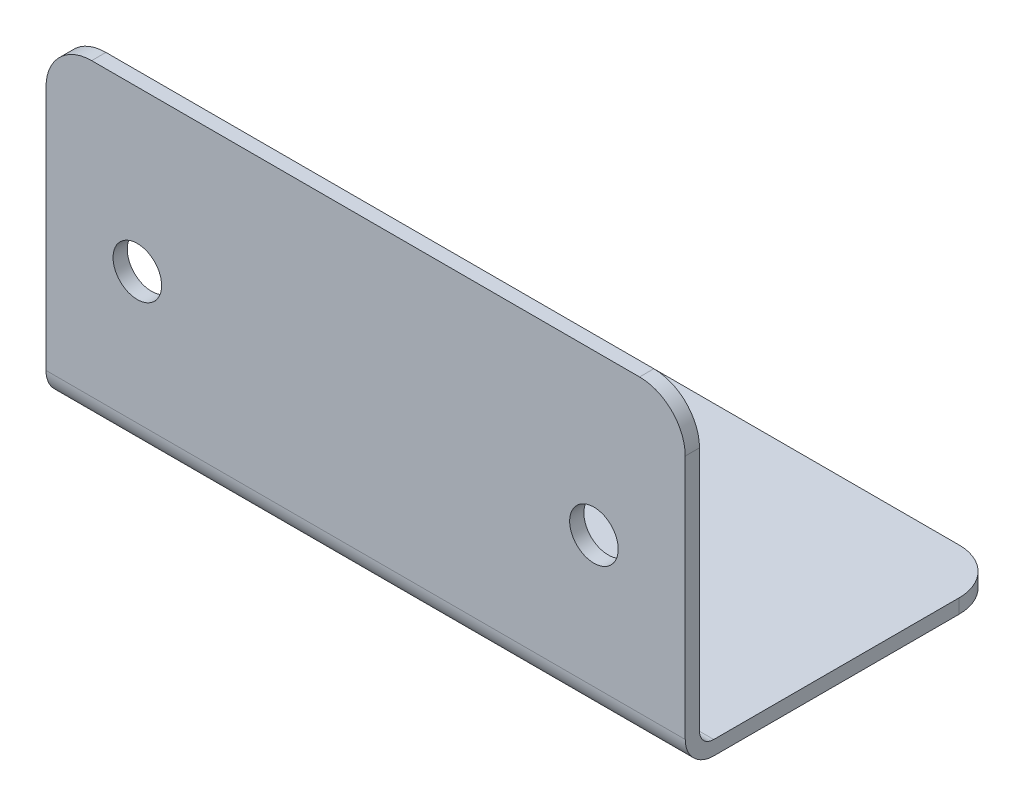
ISO-10303-21;
HEADER;
FILE_DESCRIPTION(('STEP AP214'),'2;1');
FILE_NAME('part.step','',(''),(''),'','','');
FILE_SCHEMA(('AUTOMOTIVE_DESIGN { 1 0 10303 214 1 1 1 1 }'));
ENDSEC;
DATA;
#1=APPLICATION_CONTEXT('core data for automotive mechanical design processes');
#2=APPLICATION_PROTOCOL_DEFINITION('international standard','automotive_design',2000,#1);
#3=PRODUCT_CONTEXT('',#1,'mechanical');
#4=PRODUCT('Part','Part','',(#3));
#5=PRODUCT_RELATED_PRODUCT_CATEGORY('part','',(#4));
#6=PRODUCT_DEFINITION_FORMATION('','',#4);
#7=PRODUCT_DEFINITION_CONTEXT('part definition',#1,'design');
#8=PRODUCT_DEFINITION('design','',#6,#7);
#9=PRODUCT_DEFINITION_SHAPE('','',#8);
#10=(LENGTH_UNIT() NAMED_UNIT(*) SI_UNIT(.MILLI.,.METRE.));
#11=(NAMED_UNIT(*) PLANE_ANGLE_UNIT() SI_UNIT($,.RADIAN.));
#12=(NAMED_UNIT(*) SI_UNIT($,.STERADIAN.) SOLID_ANGLE_UNIT());
#13=UNCERTAINTY_MEASURE_WITH_UNIT(LENGTH_MEASURE(1.E-05),#10,'distance_accuracy_value','');
#14=(GEOMETRIC_REPRESENTATION_CONTEXT(3) GLOBAL_UNCERTAINTY_ASSIGNED_CONTEXT((#13)) GLOBAL_UNIT_ASSIGNED_CONTEXT((#10,
#11,#12)) REPRESENTATION_CONTEXT('',''));
#15=CARTESIAN_POINT('',(0.,0.,0.));
#16=DIRECTION('',(0.,0.,1.));
#17=DIRECTION('',(1.,0.,0.));
#18=AXIS2_PLACEMENT_3D('',#15,#16,#17);
#19=CARTESIAN_POINT('',(88.9,44.45,-1.98119999999999));
#20=DIRECTION('',(0.,-1.,0.));
#21=DIRECTION('',(0.,0.,-1.));
#22=AXIS2_PLACEMENT_3D('',#19,#20,#21);
#23=PLANE('',#22);
#24=DIRECTION('',(-1.,0.,0.));
#25=VECTOR('',#24,1.);
#26=CARTESIAN_POINT('',(88.9,44.45,0.));
#27=LINE('',#26,#25);
#28=CARTESIAN_POINT('',(82.55,44.45,0.));
#29=VERTEX_POINT('',#28);
#30=CARTESIAN_POINT('',(6.34999999999999,44.45,0.));
#31=VERTEX_POINT('',#30);
#32=EDGE_CURVE('E144',#29,#31,#27,.T.);
#33=ORIENTED_EDGE('',*,*,#32,.F.);
#34=DIRECTION('',(0.,0.,1.));
#35=VECTOR('',#34,1.);
#36=CARTESIAN_POINT('',(82.55,44.45,-1.98119999999999));
#37=LINE('',#36,#35);
#38=CARTESIAN_POINT('',(82.55,44.45,-1.98119999999999));
#39=VERTEX_POINT('',#38);
#40=EDGE_CURVE('E58',#29,#39,#37,.F.);
#41=ORIENTED_EDGE('',*,*,#40,.T.);
#42=DIRECTION('',(-1.,0.,0.));
#43=VECTOR('',#42,1.);
#44=CARTESIAN_POINT('',(88.9,44.45,-1.98119999999999));
#45=LINE('',#44,#43);
#46=CARTESIAN_POINT('',(6.34999999999999,44.45,-1.98119999999999));
#47=VERTEX_POINT('',#46);
#48=EDGE_CURVE('E159',#39,#47,#45,.T.);
#49=ORIENTED_EDGE('',*,*,#48,.T.);
#50=DIRECTION('',(0.,0.,1.));
#51=VECTOR('',#50,1.);
#52=CARTESIAN_POINT('',(6.34999999999999,44.45,-1.98119999999999));
#53=LINE('',#52,#51);
#54=EDGE_CURVE('E208',#47,#31,#53,.T.);
#55=ORIENTED_EDGE('',*,*,#54,.T.);
#56=EDGE_LOOP('',(#33,#41,#49,#55));
#57=FACE_BOUND('',#56,.T.);
#58=ADVANCED_FACE('F35',(#57),#23,.F.);
#59=CARTESIAN_POINT('',(88.9,44.45,0.));
#60=DIRECTION('',(0.,0.,-1.));
#61=DIRECTION('',(-1.,0.,0.));
#62=AXIS2_PLACEMENT_3D('',#59,#60,#61);
#63=PLANE('',#62);
#64=CARTESIAN_POINT('',(12.7,22.225,0.));
#65=DIRECTION('',(0.,0.,1.));
#66=DIRECTION('',(1.,0.,0.));
#67=AXIS2_PLACEMENT_3D('',#64,#65,#66);
#68=CIRCLE('',#67,3.3782);
#69=CARTESIAN_POINT('',(16.0782,22.225,0.));
#70=VERTEX_POINT('',#69);
#71=EDGE_CURVE('E214',#70,#70,#68,.T.);
#72=ORIENTED_EDGE('',*,*,#71,.F.);
#73=EDGE_LOOP('',(#72));
#74=FACE_BOUND('',#73,.T.);
#75=CARTESIAN_POINT('',(76.2,22.225,0.));
#76=DIRECTION('',(0.,0.,1.));
#77=DIRECTION('',(1.,0.,0.));
#78=AXIS2_PLACEMENT_3D('',#75,#76,#77);
#79=CIRCLE('',#78,3.37819999999999);
#80=CARTESIAN_POINT('',(79.5782,22.225,0.));
#81=VERTEX_POINT('',#80);
#82=EDGE_CURVE('E220',#81,#81,#79,.T.);
#83=ORIENTED_EDGE('',*,*,#82,.F.);
#84=EDGE_LOOP('',(#83));
#85=FACE_BOUND('',#84,.T.);
#86=DIRECTION('',(0.,-1.,0.));
#87=VECTOR('',#86,1.);
#88=CARTESIAN_POINT('',(88.9,44.45,0.));
#89=LINE('',#88,#87);
#90=CARTESIAN_POINT('',(88.9,38.1,0.));
#91=VERTEX_POINT('',#90);
#92=CARTESIAN_POINT('',(88.9,3.9624,0.));
#93=VERTEX_POINT('',#92);
#94=EDGE_CURVE('E150',#91,#93,#89,.T.);
#95=ORIENTED_EDGE('',*,*,#94,.F.);
#96=CARTESIAN_POINT('',(82.55,38.1,0.));
#97=DIRECTION('',(0.,0.,-1.));
#98=DIRECTION('',(-1.,0.,0.));
#99=AXIS2_PLACEMENT_3D('',#96,#97,#98);
#100=CIRCLE('',#99,6.35);
#101=EDGE_CURVE('E206',#91,#29,#100,.F.);
#102=ORIENTED_EDGE('',*,*,#101,.T.);
#103=ORIENTED_EDGE('',*,*,#32,.T.);
#104=CARTESIAN_POINT('',(6.34999999999999,38.1,0.));
#105=DIRECTION('',(0.,0.,-1.));
#106=DIRECTION('',(-1.,0.,0.));
#107=AXIS2_PLACEMENT_3D('',#104,#105,#106);
#108=CIRCLE('',#107,6.35);
#109=CARTESIAN_POINT('',(0.,38.1,0.));
#110=VERTEX_POINT('',#109);
#111=EDGE_CURVE('E204',#31,#110,#108,.F.);
#112=ORIENTED_EDGE('',*,*,#111,.T.);
#113=DIRECTION('',(0.,-1.,0.));
#114=VECTOR('',#113,1.);
#115=CARTESIAN_POINT('',(0.,44.45,0.));
#116=LINE('',#115,#114);
#117=CARTESIAN_POINT('',(0.,3.9624,0.));
#118=VERTEX_POINT('',#117);
#119=EDGE_CURVE('E218',#110,#118,#116,.T.);
#120=ORIENTED_EDGE('',*,*,#119,.T.);
#121=DIRECTION('',(-1.,0.,0.));
#122=VECTOR('',#121,1.);
#123=CARTESIAN_POINT('',(88.9,3.9624,0.));
#124=LINE('',#123,#122);
#125=EDGE_CURVE('E177',#118,#93,#124,.F.);
#126=ORIENTED_EDGE('',*,*,#125,.T.);
#127=EDGE_LOOP('',(#95,#102,#103,#112,#120,#126));
#128=FACE_BOUND('',#127,.T.);
#129=ADVANCED_FACE('F265',(#74,#85,#128),#63,.F.);
#130=CARTESIAN_POINT('',(88.9,0.,0.));
#131=DIRECTION('',(0.,1.,0.));
#132=DIRECTION('',(0.,0.,1.));
#133=AXIS2_PLACEMENT_3D('',#130,#131,#132);
#134=PLANE('',#133);
#135=DIRECTION('',(0.,0.,-1.));
#136=VECTOR('',#135,1.);
#137=CARTESIAN_POINT('',(0.,0.,0.));
#138=LINE('',#137,#136);
#139=CARTESIAN_POINT('',(0.,0.,-3.9624));
#140=VERTEX_POINT('',#139);
#141=CARTESIAN_POINT('',(0.,0.,-38.1));
#142=VERTEX_POINT('',#141);
#143=EDGE_CURVE('E155',#140,#142,#138,.T.);
#144=ORIENTED_EDGE('',*,*,#143,.T.);
#145=CARTESIAN_POINT('',(6.34999999999999,0.,-38.1));
#146=DIRECTION('',(0.,1.,0.));
#147=DIRECTION('',(0.,0.,1.));
#148=AXIS2_PLACEMENT_3D('',#145,#146,#147);
#149=CIRCLE('',#148,6.35);
#150=CARTESIAN_POINT('',(6.34999999999999,0.,-44.45));
#151=VERTEX_POINT('',#150);
#152=EDGE_CURVE('E196',#142,#151,#149,.F.);
#153=ORIENTED_EDGE('',*,*,#152,.T.);
#154=DIRECTION('',(-1.,0.,0.));
#155=VECTOR('',#154,1.);
#156=CARTESIAN_POINT('',(88.9,0.,-44.45));
#157=LINE('',#156,#155);
#158=CARTESIAN_POINT('',(82.55,0.,-44.45));
#159=VERTEX_POINT('',#158);
#160=EDGE_CURVE('E164',#159,#151,#157,.T.);
#161=ORIENTED_EDGE('',*,*,#160,.F.);
#162=CARTESIAN_POINT('',(82.55,0.,-38.1));
#163=DIRECTION('',(0.,1.,0.));
#164=DIRECTION('',(0.,0.,1.));
#165=AXIS2_PLACEMENT_3D('',#162,#163,#164);
#166=CIRCLE('',#165,6.35);
#167=CARTESIAN_POINT('',(88.9,0.,-38.1));
#168=VERTEX_POINT('',#167);
#169=EDGE_CURVE('E194',#159,#168,#166,.F.);
#170=ORIENTED_EDGE('',*,*,#169,.T.);
#171=DIRECTION('',(0.,0.,-1.));
#172=VECTOR('',#171,1.);
#173=CARTESIAN_POINT('',(88.9,0.,0.));
#174=LINE('',#173,#172);
#175=CARTESIAN_POINT('',(88.9,0.,-3.9624));
#176=VERTEX_POINT('',#175);
#177=EDGE_CURVE('E153',#176,#168,#174,.T.);
#178=ORIENTED_EDGE('',*,*,#177,.F.);
#179=DIRECTION('',(-1.,0.,0.));
#180=VECTOR('',#179,1.);
#181=CARTESIAN_POINT('',(88.9,0.,-3.9624));
#182=LINE('',#181,#180);
#183=EDGE_CURVE('E171',#176,#140,#182,.T.);
#184=ORIENTED_EDGE('',*,*,#183,.T.);
#185=EDGE_LOOP('',(#144,#153,#161,#170,#178,#184));
#186=FACE_BOUND('',#185,.T.);
#187=ADVANCED_FACE('F236',(#186),#134,.F.);
#188=CARTESIAN_POINT('',(88.9,0.,-44.45));
#189=DIRECTION('',(0.,0.,1.));
#190=DIRECTION('',(1.,0.,0.));
#191=AXIS2_PLACEMENT_3D('',#188,#189,#190);
#192=PLANE('',#191);
#193=ORIENTED_EDGE('',*,*,#160,.T.);
#194=DIRECTION('',(0.,1.,0.));
#195=VECTOR('',#194,1.);
#196=CARTESIAN_POINT('',(6.34999999999999,0.,-44.45));
#197=LINE('',#196,#195);
#198=CARTESIAN_POINT('',(6.34999999999999,1.9812,-44.45));
#199=VERTEX_POINT('',#198);
#200=EDGE_CURVE('E184',#151,#199,#197,.T.);
#201=ORIENTED_EDGE('',*,*,#200,.T.);
#202=DIRECTION('',(-1.,0.,0.));
#203=VECTOR('',#202,1.);
#204=CARTESIAN_POINT('',(88.9,1.9812,-44.45));
#205=LINE('',#204,#203);
#206=CARTESIAN_POINT('',(82.55,1.9812,-44.45));
#207=VERTEX_POINT('',#206);
#208=EDGE_CURVE('E161',#207,#199,#205,.T.);
#209=ORIENTED_EDGE('',*,*,#208,.F.);
#210=DIRECTION('',(0.,1.,0.));
#211=VECTOR('',#210,1.);
#212=CARTESIAN_POINT('',(82.55,0.,-44.45));
#213=LINE('',#212,#211);
#214=EDGE_CURVE('E182',#207,#159,#213,.F.);
#215=ORIENTED_EDGE('',*,*,#214,.T.);
#216=EDGE_LOOP('',(#193,#201,#209,#215));
#217=FACE_BOUND('',#216,.T.);
#218=ADVANCED_FACE('F246',(#217),#192,.F.);
#219=CARTESIAN_POINT('',(88.9,1.9812,-44.45));
#220=DIRECTION('',(0.,-1.,0.));
#221=DIRECTION('',(0.,0.,-1.));
#222=AXIS2_PLACEMENT_3D('',#219,#220,#221);
#223=PLANE('',#222);
#224=ORIENTED_EDGE('',*,*,#208,.T.);
#225=CARTESIAN_POINT('',(6.34999999999999,1.9812,-38.1));
#226=DIRECTION('',(0.,-1.,0.));
#227=DIRECTION('',(0.,0.,-1.));
#228=AXIS2_PLACEMENT_3D('',#225,#226,#227);
#229=CIRCLE('',#228,6.35);
#230=CARTESIAN_POINT('',(0.,1.9812,-38.1));
#231=VERTEX_POINT('',#230);
#232=EDGE_CURVE('E189',#199,#231,#229,.F.);
#233=ORIENTED_EDGE('',*,*,#232,.T.);
#234=DIRECTION('',(0.,0.,1.));
#235=VECTOR('',#234,1.);
#236=CARTESIAN_POINT('',(0.,1.9812,-44.45));
#237=LINE('',#236,#235);
#238=CARTESIAN_POINT('',(0.,1.9812,-3.96240000000001));
#239=VERTEX_POINT('',#238);
#240=EDGE_CURVE('E151',#231,#239,#237,.T.);
#241=ORIENTED_EDGE('',*,*,#240,.T.);
#242=DIRECTION('',(-1.,0.,0.));
#243=VECTOR('',#242,1.);
#244=CARTESIAN_POINT('',(88.9,1.9812,-3.96239999999999));
#245=LINE('',#244,#243);
#246=CARTESIAN_POINT('',(88.9,1.9812,-3.96240000000001));
#247=VERTEX_POINT('',#246);
#248=EDGE_CURVE('E133',#239,#247,#245,.F.);
#249=ORIENTED_EDGE('',*,*,#248,.T.);
#250=DIRECTION('',(0.,0.,1.));
#251=VECTOR('',#250,1.);
#252=CARTESIAN_POINT('',(88.9,1.9812,-44.45));
#253=LINE('',#252,#251);
#254=CARTESIAN_POINT('',(88.9,1.9812,-38.1));
#255=VERTEX_POINT('',#254);
#256=EDGE_CURVE('E229',#255,#247,#253,.T.);
#257=ORIENTED_EDGE('',*,*,#256,.F.);
#258=CARTESIAN_POINT('',(82.55,1.9812,-38.1));
#259=DIRECTION('',(0.,-1.,0.));
#260=DIRECTION('',(0.,0.,-1.));
#261=AXIS2_PLACEMENT_3D('',#258,#259,#260);
#262=CIRCLE('',#261,6.35);
#263=EDGE_CURVE('E187',#255,#207,#262,.F.);
#264=ORIENTED_EDGE('',*,*,#263,.T.);
#265=EDGE_LOOP('',(#224,#233,#241,#249,#257,#264));
#266=FACE_BOUND('',#265,.T.);
#267=ADVANCED_FACE('F249',(#266),#223,.F.);
#268=CARTESIAN_POINT('',(88.9,1.9812,-1.98119999999999));
#269=DIRECTION('',(0.,0.,1.));
#270=DIRECTION('',(1.,0.,0.));
#271=AXIS2_PLACEMENT_3D('',#268,#269,#270);
#272=PLANE('',#271);
#273=CARTESIAN_POINT('',(12.7,22.225,-1.98119999999999));
#274=DIRECTION('',(0.,0.,1.));
#275=DIRECTION('',(1.,0.,0.));
#276=AXIS2_PLACEMENT_3D('',#273,#274,#275);
#277=CIRCLE('',#276,3.3782);
#278=CARTESIAN_POINT('',(16.0782,22.225,-1.98119999999999));
#279=VERTEX_POINT('',#278);
#280=EDGE_CURVE('E39',#279,#279,#277,.T.);
#281=ORIENTED_EDGE('',*,*,#280,.T.);
#282=EDGE_LOOP('',(#281));
#283=FACE_BOUND('',#282,.T.);
#284=CARTESIAN_POINT('',(76.2,22.225,-1.98119999999999));
#285=DIRECTION('',(0.,0.,1.));
#286=DIRECTION('',(1.,0.,0.));
#287=AXIS2_PLACEMENT_3D('',#284,#285,#286);
#288=CIRCLE('',#287,3.37819999999999);
#289=CARTESIAN_POINT('',(79.5782,22.225,-1.98119999999999));
#290=VERTEX_POINT('',#289);
#291=EDGE_CURVE('E212',#290,#290,#288,.T.);
#292=ORIENTED_EDGE('',*,*,#291,.T.);
#293=EDGE_LOOP('',(#292));
#294=FACE_BOUND('',#293,.T.);
#295=ORIENTED_EDGE('',*,*,#48,.F.);
#296=CARTESIAN_POINT('',(82.55,38.1,-1.98119999999999));
#297=DIRECTION('',(0.,0.,1.));
#298=DIRECTION('',(1.,0.,0.));
#299=AXIS2_PLACEMENT_3D('',#296,#297,#298);
#300=CIRCLE('',#299,6.35);
#301=CARTESIAN_POINT('',(88.9,38.1,-1.98119999999999));
#302=VERTEX_POINT('',#301);
#303=EDGE_CURVE('E11',#39,#302,#300,.F.);
#304=ORIENTED_EDGE('',*,*,#303,.T.);
#305=DIRECTION('',(0.,1.,0.));
#306=VECTOR('',#305,1.);
#307=CARTESIAN_POINT('',(88.9,1.9812,-1.98119999999999));
#308=LINE('',#307,#306);
#309=CARTESIAN_POINT('',(88.9,3.96239999999999,-1.98119999999999));
#310=VERTEX_POINT('',#309);
#311=EDGE_CURVE('E143',#310,#302,#308,.T.);
#312=ORIENTED_EDGE('',*,*,#311,.F.);
#313=DIRECTION('',(-1.,0.,0.));
#314=VECTOR('',#313,1.);
#315=CARTESIAN_POINT('',(0.,3.9624,-1.98119999999999));
#316=LINE('',#315,#314);
#317=CARTESIAN_POINT('',(0.,3.96239999999999,-1.98119999999999));
#318=VERTEX_POINT('',#317);
#319=EDGE_CURVE('E131',#310,#318,#316,.T.);
#320=ORIENTED_EDGE('',*,*,#319,.T.);
#321=DIRECTION('',(0.,1.,0.));
#322=VECTOR('',#321,1.);
#323=CARTESIAN_POINT('',(0.,1.9812,-1.98119999999999));
#324=LINE('',#323,#322);
#325=CARTESIAN_POINT('',(0.,38.1,-1.98119999999999));
#326=VERTEX_POINT('',#325);
#327=EDGE_CURVE('E141',#318,#326,#324,.T.);
#328=ORIENTED_EDGE('',*,*,#327,.T.);
#329=CARTESIAN_POINT('',(6.34999999999999,38.1,-1.98119999999999));
#330=DIRECTION('',(0.,0.,1.));
#331=DIRECTION('',(1.,0.,0.));
#332=AXIS2_PLACEMENT_3D('',#329,#330,#331);
#333=CIRCLE('',#332,6.35);
#334=EDGE_CURVE('E44',#326,#47,#333,.F.);
#335=ORIENTED_EDGE('',*,*,#334,.T.);
#336=EDGE_LOOP('',(#295,#304,#312,#320,#328,#335));
#337=FACE_BOUND('',#336,.T.);
#338=ADVANCED_FACE('F140',(#283,#294,#337),#272,.F.);
#339=CARTESIAN_POINT('',(88.9,0.,0.));
#340=DIRECTION('',(1.,0.,0.));
#341=DIRECTION('',(0.,0.,-1.));
#342=AXIS2_PLACEMENT_3D('',#339,#340,#341);
#343=PLANE('',#342);
#344=ORIENTED_EDGE('',*,*,#177,.T.);
#345=DIRECTION('',(0.,1.,0.));
#346=VECTOR('',#345,1.);
#347=CARTESIAN_POINT('',(88.9,1.9812,-38.1));
#348=LINE('',#347,#346);
#349=EDGE_CURVE('E201',#168,#255,#348,.T.);
#350=ORIENTED_EDGE('',*,*,#349,.T.);
#351=ORIENTED_EDGE('',*,*,#256,.T.);
#352=CARTESIAN_POINT('',(88.9,3.9624,-3.96239999999999));
#353=DIRECTION('',(1.,0.,0.));
#354=DIRECTION('',(0.,0.,-1.));
#355=AXIS2_PLACEMENT_3D('',#352,#353,#354);
#356=CIRCLE('',#355,1.9812);
#357=EDGE_CURVE('E137',#247,#310,#356,.F.);
#358=ORIENTED_EDGE('',*,*,#357,.T.);
#359=ORIENTED_EDGE('',*,*,#311,.T.);
#360=DIRECTION('',(0.,0.,1.));
#361=VECTOR('',#360,1.);
#362=CARTESIAN_POINT('',(88.9,38.1,0.));
#363=LINE('',#362,#361);
#364=EDGE_CURVE('E198',#302,#91,#363,.T.);
#365=ORIENTED_EDGE('',*,*,#364,.T.);
#366=ORIENTED_EDGE('',*,*,#94,.T.);
#367=CARTESIAN_POINT('',(88.9,3.9624,-3.9624));
#368=DIRECTION('',(1.,0.,0.));
#369=DIRECTION('',(0.,0.,-1.));
#370=AXIS2_PLACEMENT_3D('',#367,#368,#369);
#371=CIRCLE('',#370,3.9624);
#372=EDGE_CURVE('E180',#93,#176,#371,.T.);
#373=ORIENTED_EDGE('',*,*,#372,.T.);
#374=EDGE_LOOP('',(#344,#350,#351,#358,#359,#365,#366,#373));
#375=FACE_BOUND('',#374,.T.);
#376=ADVANCED_FACE('F256',(#375),#343,.T.);
#377=CARTESIAN_POINT('',(0.,0.,0.));
#378=DIRECTION('',(1.,0.,0.));
#379=DIRECTION('',(0.,0.,-1.));
#380=AXIS2_PLACEMENT_3D('',#377,#378,#379);
#381=PLANE('',#380);
#382=ORIENTED_EDGE('',*,*,#240,.F.);
#383=DIRECTION('',(0.,1.,0.));
#384=VECTOR('',#383,1.);
#385=CARTESIAN_POINT('',(0.,0.,-38.1));
#386=LINE('',#385,#384);
#387=EDGE_CURVE('E192',#231,#142,#386,.F.);
#388=ORIENTED_EDGE('',*,*,#387,.T.);
#389=ORIENTED_EDGE('',*,*,#143,.F.);
#390=CARTESIAN_POINT('',(0.,3.9624,-3.9624));
#391=DIRECTION('',(1.,0.,0.));
#392=DIRECTION('',(0.,0.,-1.));
#393=AXIS2_PLACEMENT_3D('',#390,#391,#392);
#394=CIRCLE('',#393,3.9624);
#395=EDGE_CURVE('E174',#140,#118,#394,.F.);
#396=ORIENTED_EDGE('',*,*,#395,.T.);
#397=ORIENTED_EDGE('',*,*,#119,.F.);
#398=DIRECTION('',(0.,0.,1.));
#399=VECTOR('',#398,1.);
#400=CARTESIAN_POINT('',(0.,38.1,0.));
#401=LINE('',#400,#399);
#402=EDGE_CURVE('E149',#110,#326,#401,.F.);
#403=ORIENTED_EDGE('',*,*,#402,.T.);
#404=ORIENTED_EDGE('',*,*,#327,.F.);
#405=CARTESIAN_POINT('',(0.,3.9624,-3.96239999999999));
#406=DIRECTION('',(1.,0.,0.));
#407=DIRECTION('',(0.,0.,-1.));
#408=AXIS2_PLACEMENT_3D('',#405,#406,#407);
#409=CIRCLE('',#408,1.9812);
#410=EDGE_CURVE('E127',#318,#239,#409,.T.);
#411=ORIENTED_EDGE('',*,*,#410,.T.);
#412=EDGE_LOOP('',(#382,#388,#389,#396,#397,#403,#404,#411));
#413=FACE_BOUND('',#412,.T.);
#414=ADVANCED_FACE('F146',(#413),#381,.F.);
#415=CARTESIAN_POINT('',(88.9,3.9624,-3.96239999999999));
#416=DIRECTION('',(1.,0.,0.));
#417=DIRECTION('',(0.,0.,-1.));
#418=AXIS2_PLACEMENT_3D('',#415,#416,#417);
#419=CYLINDRICAL_SURFACE('',#418,1.9812);
#420=ORIENTED_EDGE('',*,*,#357,.F.);
#421=ORIENTED_EDGE('',*,*,#248,.F.);
#422=ORIENTED_EDGE('',*,*,#410,.F.);
#423=ORIENTED_EDGE('',*,*,#319,.F.);
#424=EDGE_LOOP('',(#420,#421,#422,#423));
#425=FACE_BOUND('',#424,.T.);
#426=ADVANCED_FACE('F130',(#425),#419,.F.);
#427=CARTESIAN_POINT('',(88.9,3.9624,-3.9624));
#428=DIRECTION('',(-1.,0.,0.));
#429=DIRECTION('',(0.,0.,1.));
#430=AXIS2_PLACEMENT_3D('',#427,#428,#429);
#431=CYLINDRICAL_SURFACE('',#430,3.9624);
#432=ORIENTED_EDGE('',*,*,#372,.F.);
#433=ORIENTED_EDGE('',*,*,#125,.F.);
#434=ORIENTED_EDGE('',*,*,#395,.F.);
#435=ORIENTED_EDGE('',*,*,#183,.F.);
#436=EDGE_LOOP('',(#432,#433,#434,#435));
#437=FACE_BOUND('',#436,.T.);
#438=ADVANCED_FACE('F259',(#437),#431,.T.);
#439=CARTESIAN_POINT('',(6.34999999999999,0.,-38.1));
#440=DIRECTION('',(0.,1.,0.));
#441=DIRECTION('',(0.,0.,1.));
#442=AXIS2_PLACEMENT_3D('',#439,#440,#441);
#443=CYLINDRICAL_SURFACE('',#442,6.35);
#444=ORIENTED_EDGE('',*,*,#152,.F.);
#445=ORIENTED_EDGE('',*,*,#387,.F.);
#446=ORIENTED_EDGE('',*,*,#232,.F.);
#447=ORIENTED_EDGE('',*,*,#200,.F.);
#448=EDGE_LOOP('',(#444,#445,#446,#447));
#449=FACE_BOUND('',#448,.T.);
#450=ADVANCED_FACE('F243',(#449),#443,.T.);
#451=CARTESIAN_POINT('',(82.55,0.,-38.1));
#452=DIRECTION('',(0.,-1.,0.));
#453=DIRECTION('',(0.,0.,-1.));
#454=AXIS2_PLACEMENT_3D('',#451,#452,#453);
#455=CYLINDRICAL_SURFACE('',#454,6.35);
#456=ORIENTED_EDGE('',*,*,#169,.F.);
#457=ORIENTED_EDGE('',*,*,#214,.F.);
#458=ORIENTED_EDGE('',*,*,#263,.F.);
#459=ORIENTED_EDGE('',*,*,#349,.F.);
#460=EDGE_LOOP('',(#456,#457,#458,#459));
#461=FACE_BOUND('',#460,.T.);
#462=ADVANCED_FACE('F254',(#461),#455,.T.);
#463=CARTESIAN_POINT('',(82.55,38.1,0.));
#464=DIRECTION('',(0.,0.,-1.));
#465=DIRECTION('',(-1.,0.,0.));
#466=AXIS2_PLACEMENT_3D('',#463,#464,#465);
#467=CYLINDRICAL_SURFACE('',#466,6.35);
#468=ORIENTED_EDGE('',*,*,#303,.F.);
#469=ORIENTED_EDGE('',*,*,#40,.F.);
#470=ORIENTED_EDGE('',*,*,#101,.F.);
#471=ORIENTED_EDGE('',*,*,#364,.F.);
#472=EDGE_LOOP('',(#468,#469,#470,#471));
#473=FACE_BOUND('',#472,.T.);
#474=ADVANCED_FACE('F269',(#473),#467,.T.);
#475=CARTESIAN_POINT('',(6.34999999999999,38.1,-1.98119999999999));
#476=DIRECTION('',(0.,0.,1.));
#477=DIRECTION('',(1.,0.,0.));
#478=AXIS2_PLACEMENT_3D('',#475,#476,#477);
#479=CYLINDRICAL_SURFACE('',#478,6.35);
#480=ORIENTED_EDGE('',*,*,#334,.F.);
#481=ORIENTED_EDGE('',*,*,#402,.F.);
#482=ORIENTED_EDGE('',*,*,#111,.F.);
#483=ORIENTED_EDGE('',*,*,#54,.F.);
#484=EDGE_LOOP('',(#480,#481,#482,#483));
#485=FACE_BOUND('',#484,.T.);
#486=ADVANCED_FACE('F37',(#485),#479,.T.);
#487=CARTESIAN_POINT('',(76.2,22.225,-88.9));
#488=DIRECTION('',(0.,0.,1.));
#489=DIRECTION('',(1.,0.,0.));
#490=AXIS2_PLACEMENT_3D('',#487,#488,#489);
#491=CYLINDRICAL_SURFACE('',#490,3.37819999999999);
#492=ORIENTED_EDGE('',*,*,#82,.T.);
#493=EDGE_LOOP('',(#492));
#494=FACE_BOUND('',#493,.T.);
#495=ORIENTED_EDGE('',*,*,#291,.F.);
#496=EDGE_LOOP('',(#495));
#497=FACE_BOUND('',#496,.T.);
#498=ADVANCED_FACE('F275',(#494,#497),#491,.F.);
#499=CARTESIAN_POINT('',(12.7,22.225,-88.9));
#500=DIRECTION('',(0.,0.,1.));
#501=DIRECTION('',(1.,0.,0.));
#502=AXIS2_PLACEMENT_3D('',#499,#500,#501);
#503=CYLINDRICAL_SURFACE('',#502,3.3782);
#504=ORIENTED_EDGE('',*,*,#71,.T.);
#505=EDGE_LOOP('',(#504));
#506=FACE_BOUND('',#505,.T.);
#507=ORIENTED_EDGE('',*,*,#280,.F.);
#508=EDGE_LOOP('',(#507));
#509=FACE_BOUND('',#508,.T.);
#510=ADVANCED_FACE('F341',(#506,#509),#503,.F.);
#511=CLOSED_SHELL('',(#58,#129,#187,#218,#267,#338,#376,#414,#426,#438,#450,#462,#474,#486,#498,#510));
#512=MANIFOLD_SOLID_BREP('B2',#511);
#513=ADVANCED_BREP_SHAPE_REPRESENTATION('',(#18,#512),#14);
#514=SHAPE_DEFINITION_REPRESENTATION(#9,#513);
ENDSEC;
END-ISO-10303-21;
